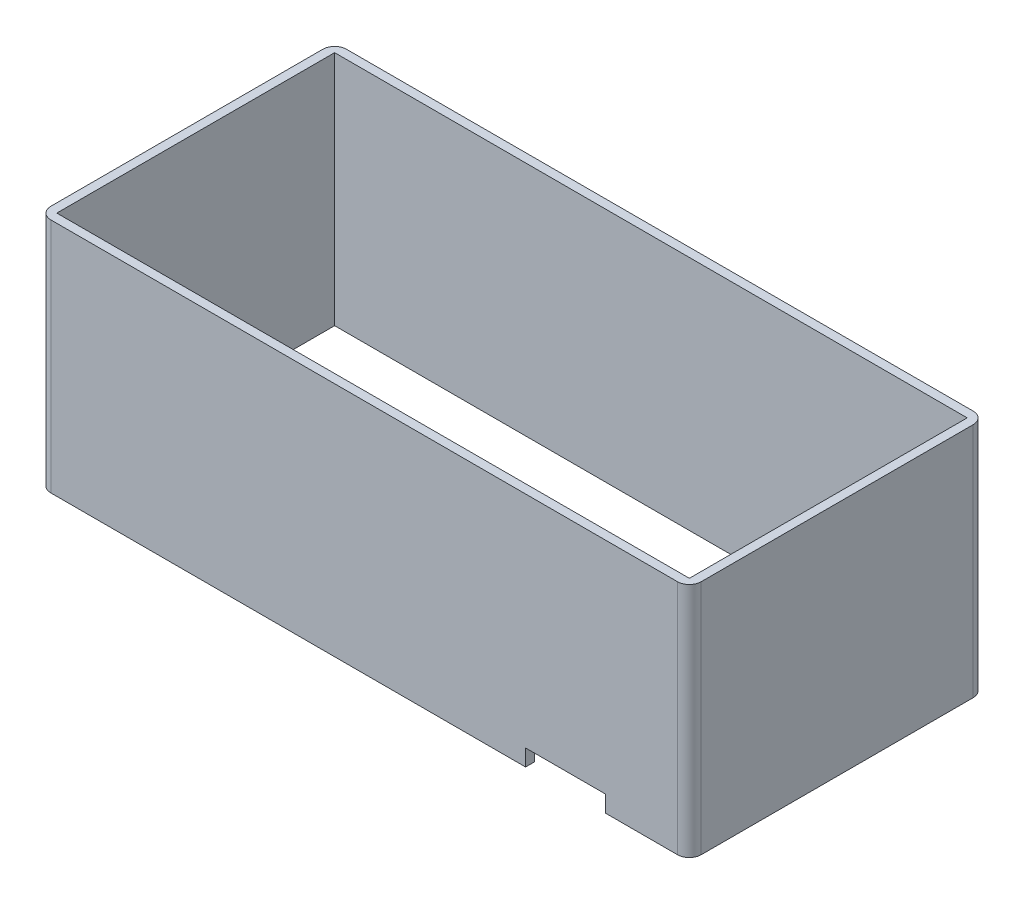
ISO-10303-21;
HEADER;
FILE_DESCRIPTION(('STEP AP214'),'2;1');
FILE_NAME('part.step','',(''),(''),'','','');
FILE_SCHEMA(('AUTOMOTIVE_DESIGN { 1 0 10303 214 1 1 1 1 }'));
ENDSEC;
DATA;
#1=APPLICATION_CONTEXT('core data for automotive mechanical design processes');
#2=APPLICATION_PROTOCOL_DEFINITION('international standard','automotive_design',2000,#1);
#3=PRODUCT_CONTEXT('',#1,'mechanical');
#4=PRODUCT('Part','Part','',(#3));
#5=PRODUCT_RELATED_PRODUCT_CATEGORY('part','',(#4));
#6=PRODUCT_DEFINITION_FORMATION('','',#4);
#7=PRODUCT_DEFINITION_CONTEXT('part definition',#1,'design');
#8=PRODUCT_DEFINITION('design','',#6,#7);
#9=PRODUCT_DEFINITION_SHAPE('','',#8);
#10=(LENGTH_UNIT() NAMED_UNIT(*) SI_UNIT(.MILLI.,.METRE.));
#11=(NAMED_UNIT(*) PLANE_ANGLE_UNIT() SI_UNIT($,.RADIAN.));
#12=(NAMED_UNIT(*) SI_UNIT($,.STERADIAN.) SOLID_ANGLE_UNIT());
#13=UNCERTAINTY_MEASURE_WITH_UNIT(LENGTH_MEASURE(1.E-05),#10,'distance_accuracy_value','');
#14=(GEOMETRIC_REPRESENTATION_CONTEXT(3) GLOBAL_UNCERTAINTY_ASSIGNED_CONTEXT((#13)) GLOBAL_UNIT_ASSIGNED_CONTEXT((#10,
#11,#12)) REPRESENTATION_CONTEXT('',''));
#15=CARTESIAN_POINT('',(0.,0.,0.));
#16=DIRECTION('',(0.,0.,1.));
#17=DIRECTION('',(1.,0.,0.));
#18=AXIS2_PLACEMENT_3D('',#15,#16,#17);
#19=CARTESIAN_POINT('',(0.,45.,0.));
#20=DIRECTION('',(0.,1.,0.));
#21=DIRECTION('',(0.,0.,1.));
#22=AXIS2_PLACEMENT_3D('',#19,#20,#21);
#23=PLANE('',#22);
#24=DIRECTION('',(1.,0.,0.));
#25=VECTOR('',#24,1.);
#26=CARTESIAN_POINT('',(-40.9090909090909,45.,30.8863636363636));
#27=LINE('',#26,#25);
#28=CARTESIAN_POINT('',(-38.9090909090909,45.,30.8863636363636));
#29=VERTEX_POINT('',#28);
#30=CARTESIAN_POINT('',(67.0909090909091,45.,30.8863636363636));
#31=VERTEX_POINT('',#30);
#32=EDGE_CURVE('E200',#29,#31,#27,.T.);
#33=ORIENTED_EDGE('',*,*,#32,.T.);
#34=CARTESIAN_POINT('',(67.0909090909091,45.,28.8863636363636));
#35=DIRECTION('',(0.,1.,0.));
#36=DIRECTION('',(0.,0.,1.));
#37=AXIS2_PLACEMENT_3D('',#34,#35,#36);
#38=CIRCLE('',#37,2.);
#39=CARTESIAN_POINT('',(69.0909090909091,45.,28.8863636363636));
#40=VERTEX_POINT('',#39);
#41=EDGE_CURVE('E261',#31,#40,#38,.T.);
#42=ORIENTED_EDGE('',*,*,#41,.T.);
#43=DIRECTION('',(0.,0.,-1.));
#44=VECTOR('',#43,1.);
#45=CARTESIAN_POINT('',(69.0909090909091,45.,-19.1136363636364));
#46=LINE('',#45,#44);
#47=CARTESIAN_POINT('',(69.0909090909091,45.,-17.1136363636364));
#48=VERTEX_POINT('',#47);
#49=EDGE_CURVE('E208',#40,#48,#46,.T.);
#50=ORIENTED_EDGE('',*,*,#49,.T.);
#51=CARTESIAN_POINT('',(67.0909090909091,45.,-17.1136363636364));
#52=DIRECTION('',(0.,1.,0.));
#53=DIRECTION('',(0.,0.,1.));
#54=AXIS2_PLACEMENT_3D('',#51,#52,#53);
#55=CIRCLE('',#54,2.);
#56=CARTESIAN_POINT('',(67.0909090909091,45.,-19.1136363636364));
#57=VERTEX_POINT('',#56);
#58=EDGE_CURVE('E259',#48,#57,#55,.T.);
#59=ORIENTED_EDGE('',*,*,#58,.T.);
#60=DIRECTION('',(-1.,0.,0.));
#61=VECTOR('',#60,1.);
#62=CARTESIAN_POINT('',(-40.9090909090909,45.,-19.1136363636364));
#63=LINE('',#62,#61);
#64=CARTESIAN_POINT('',(-38.9090909090909,45.,-19.1136363636364));
#65=VERTEX_POINT('',#64);
#66=EDGE_CURVE('E209',#57,#65,#63,.T.);
#67=ORIENTED_EDGE('',*,*,#66,.T.);
#68=CARTESIAN_POINT('',(-38.9090909090909,45.,-17.1136363636364));
#69=DIRECTION('',(0.,1.,0.));
#70=DIRECTION('',(0.,0.,1.));
#71=AXIS2_PLACEMENT_3D('',#68,#69,#70);
#72=CIRCLE('',#71,2.);
#73=CARTESIAN_POINT('',(-40.9090909090909,45.,-17.1136363636364));
#74=VERTEX_POINT('',#73);
#75=EDGE_CURVE('E257',#65,#74,#72,.T.);
#76=ORIENTED_EDGE('',*,*,#75,.T.);
#77=DIRECTION('',(0.,0.,1.));
#78=VECTOR('',#77,1.);
#79=CARTESIAN_POINT('',(-40.9090909090909,45.,-19.1136363636364));
#80=LINE('',#79,#78);
#81=CARTESIAN_POINT('',(-40.9090909090909,45.,28.8863636363636));
#82=VERTEX_POINT('',#81);
#83=EDGE_CURVE('E199',#74,#82,#80,.T.);
#84=ORIENTED_EDGE('',*,*,#83,.T.);
#85=CARTESIAN_POINT('',(-38.9090909090909,45.,28.8863636363636));
#86=DIRECTION('',(0.,1.,0.));
#87=DIRECTION('',(0.,0.,1.));
#88=AXIS2_PLACEMENT_3D('',#85,#86,#87);
#89=CIRCLE('',#88,2.);
#90=EDGE_CURVE('E255',#82,#29,#89,.T.);
#91=ORIENTED_EDGE('',*,*,#90,.T.);
#92=EDGE_LOOP('',(#33,#42,#50,#59,#67,#76,#84,#91));
#93=FACE_BOUND('',#92,.T.);
#94=DIRECTION('',(0.,0.,1.));
#95=VECTOR('',#94,1.);
#96=CARTESIAN_POINT('',(-39.4090909090909,45.,-19.1136363636364));
#97=LINE('',#96,#95);
#98=CARTESIAN_POINT('',(-39.4090909090909,45.,-17.6136363636364));
#99=VERTEX_POINT('',#98);
#100=CARTESIAN_POINT('',(-39.4090909090909,45.,29.3863636363636));
#101=VERTEX_POINT('',#100);
#102=EDGE_CURVE('E195',#99,#101,#97,.T.);
#103=ORIENTED_EDGE('',*,*,#102,.F.);
#104=DIRECTION('',(-1.,0.,0.));
#105=VECTOR('',#104,1.);
#106=CARTESIAN_POINT('',(-40.9090909090909,45.,-17.6136363636364));
#107=LINE('',#106,#105);
#108=CARTESIAN_POINT('',(67.5909090909091,45.,-17.6136363636364));
#109=VERTEX_POINT('',#108);
#110=EDGE_CURVE('E184',#109,#99,#107,.T.);
#111=ORIENTED_EDGE('',*,*,#110,.F.);
#112=DIRECTION('',(0.,0.,-1.));
#113=VECTOR('',#112,1.);
#114=CARTESIAN_POINT('',(67.5909090909091,45.,-19.1136363636364));
#115=LINE('',#114,#113);
#116=CARTESIAN_POINT('',(67.5909090909091,45.,29.3863636363636));
#117=VERTEX_POINT('',#116);
#118=EDGE_CURVE('E187',#117,#109,#115,.T.);
#119=ORIENTED_EDGE('',*,*,#118,.F.);
#120=DIRECTION('',(1.,0.,0.));
#121=VECTOR('',#120,1.);
#122=CARTESIAN_POINT('',(-40.9090909090909,45.,29.3863636363636));
#123=LINE('',#122,#121);
#124=EDGE_CURVE('E194',#101,#117,#123,.T.);
#125=ORIENTED_EDGE('',*,*,#124,.F.);
#126=EDGE_LOOP('',(#103,#111,#119,#125));
#127=FACE_BOUND('',#126,.T.);
#128=ADVANCED_FACE('F33',(#93,#127),#23,.T.);
#129=CARTESIAN_POINT('',(0.,4.99999999999999,0.));
#130=DIRECTION('',(0.,-1.,0.));
#131=DIRECTION('',(1.,0.,0.));
#132=AXIS2_PLACEMENT_3D('',#129,#130,#131);
#133=PLANE('',#132);
#134=DIRECTION('',(0.,0.,-1.));
#135=VECTOR('',#134,1.);
#136=CARTESIAN_POINT('',(41.3909090909091,4.99999999999999,30.8863636363636));
#137=LINE('',#136,#135);
#138=CARTESIAN_POINT('',(41.3909090909091,4.99999999999999,30.8863636363636));
#139=VERTEX_POINT('',#138);
#140=CARTESIAN_POINT('',(41.3909090909091,4.99999999999999,29.3863636363636));
#141=VERTEX_POINT('',#140);
#142=EDGE_CURVE('E152',#139,#141,#137,.T.);
#143=ORIENTED_EDGE('',*,*,#142,.F.);
#144=DIRECTION('',(-1.,0.,0.));
#145=VECTOR('',#144,1.);
#146=CARTESIAN_POINT('',(-40.9090909090909,4.99999999999998,30.8863636363636));
#147=LINE('',#146,#145);
#148=CARTESIAN_POINT('',(-38.9090909090909,4.99999999999998,30.8863636363636));
#149=VERTEX_POINT('',#148);
#150=EDGE_CURVE('E204',#139,#149,#147,.T.);
#151=ORIENTED_EDGE('',*,*,#150,.T.);
#152=CARTESIAN_POINT('',(-38.9090909090909,4.99999999999998,28.8863636363636));
#153=DIRECTION('',(0.,-1.,0.));
#154=DIRECTION('',(1.,0.,0.));
#155=AXIS2_PLACEMENT_3D('',#152,#153,#154);
#156=CIRCLE('',#155,2.);
#157=CARTESIAN_POINT('',(-40.9090909090909,4.99999999999998,28.8863636363636));
#158=VERTEX_POINT('',#157);
#159=EDGE_CURVE('E242',#149,#158,#156,.T.);
#160=ORIENTED_EDGE('',*,*,#159,.T.);
#161=DIRECTION('',(0.,0.,-1.));
#162=VECTOR('',#161,1.);
#163=CARTESIAN_POINT('',(-40.9090909090909,4.99999999999998,-19.1136363636364));
#164=LINE('',#163,#162);
#165=CARTESIAN_POINT('',(-40.9090909090909,4.99999999999998,-17.1136363636364));
#166=VERTEX_POINT('',#165);
#167=EDGE_CURVE('E196',#158,#166,#164,.T.);
#168=ORIENTED_EDGE('',*,*,#167,.T.);
#169=CARTESIAN_POINT('',(-38.9090909090909,4.99999999999998,-17.1136363636364));
#170=DIRECTION('',(0.,-1.,0.));
#171=DIRECTION('',(1.,0.,0.));
#172=AXIS2_PLACEMENT_3D('',#169,#170,#171);
#173=CIRCLE('',#172,2.);
#174=CARTESIAN_POINT('',(-38.9090909090909,4.99999999999998,-19.1136363636364));
#175=VERTEX_POINT('',#174);
#176=EDGE_CURVE('E244',#166,#175,#173,.T.);
#177=ORIENTED_EDGE('',*,*,#176,.T.);
#178=DIRECTION('',(1.,0.,0.));
#179=VECTOR('',#178,1.);
#180=CARTESIAN_POINT('',(-40.9090909090909,4.99999999999998,-19.1136363636364));
#181=LINE('',#180,#179);
#182=CARTESIAN_POINT('',(67.0909090909091,5.,-19.1136363636364));
#183=VERTEX_POINT('',#182);
#184=EDGE_CURVE('E176',#175,#183,#181,.T.);
#185=ORIENTED_EDGE('',*,*,#184,.T.);
#186=CARTESIAN_POINT('',(67.0909090909091,5.,-17.1136363636364));
#187=DIRECTION('',(0.,-1.,0.));
#188=DIRECTION('',(1.,0.,0.));
#189=AXIS2_PLACEMENT_3D('',#186,#187,#188);
#190=CIRCLE('',#189,2.);
#191=CARTESIAN_POINT('',(69.0909090909091,5.,-17.1136363636364));
#192=VERTEX_POINT('',#191);
#193=EDGE_CURVE('E246',#183,#192,#190,.T.);
#194=ORIENTED_EDGE('',*,*,#193,.T.);
#195=DIRECTION('',(0.,0.,1.));
#196=VECTOR('',#195,1.);
#197=CARTESIAN_POINT('',(69.0909090909091,5.,-19.1136363636364));
#198=LINE('',#197,#196);
#199=CARTESIAN_POINT('',(69.0909090909091,5.,28.8863636363636));
#200=VERTEX_POINT('',#199);
#201=EDGE_CURVE('E205',#192,#200,#198,.T.);
#202=ORIENTED_EDGE('',*,*,#201,.T.);
#203=CARTESIAN_POINT('',(67.0909090909091,5.,28.8863636363636));
#204=DIRECTION('',(0.,-1.,0.));
#205=DIRECTION('',(1.,0.,0.));
#206=AXIS2_PLACEMENT_3D('',#203,#204,#205);
#207=CIRCLE('',#206,2.);
#208=CARTESIAN_POINT('',(67.0909090909091,5.,30.8863636363636));
#209=VERTEX_POINT('',#208);
#210=EDGE_CURVE('E248',#200,#209,#207,.T.);
#211=ORIENTED_EDGE('',*,*,#210,.T.);
#212=CARTESIAN_POINT('',(54.8909090909091,5.,30.8863636363636));
#213=VERTEX_POINT('',#212);
#214=EDGE_CURVE('E201',#209,#213,#147,.T.);
#215=ORIENTED_EDGE('',*,*,#214,.T.);
#216=DIRECTION('',(0.,0.,1.));
#217=VECTOR('',#216,1.);
#218=CARTESIAN_POINT('',(54.8909090909091,5.,30.8863636363636));
#219=LINE('',#218,#217);
#220=CARTESIAN_POINT('',(54.8909090909091,5.,29.3863636363636));
#221=VERTEX_POINT('',#220);
#222=EDGE_CURVE('E164',#221,#213,#219,.T.);
#223=ORIENTED_EDGE('',*,*,#222,.F.);
#224=DIRECTION('',(-1.,0.,0.));
#225=VECTOR('',#224,1.);
#226=CARTESIAN_POINT('',(-40.9090909090909,4.99999999999998,29.3863636363636));
#227=LINE('',#226,#225);
#228=CARTESIAN_POINT('',(67.5909090909091,5.,29.3863636363636));
#229=VERTEX_POINT('',#228);
#230=EDGE_CURVE('E188',#229,#221,#227,.T.);
#231=ORIENTED_EDGE('',*,*,#230,.F.);
#232=DIRECTION('',(0.,0.,1.));
#233=VECTOR('',#232,1.);
#234=CARTESIAN_POINT('',(67.5909090909091,5.,-19.1136363636364));
#235=LINE('',#234,#233);
#236=CARTESIAN_POINT('',(67.5909090909091,4.99999999999999,-17.6136363636364));
#237=VERTEX_POINT('',#236);
#238=EDGE_CURVE('E185',#237,#229,#235,.T.);
#239=ORIENTED_EDGE('',*,*,#238,.F.);
#240=DIRECTION('',(1.,0.,0.));
#241=VECTOR('',#240,1.);
#242=CARTESIAN_POINT('',(-40.9090909090909,4.99999999999998,-17.6136363636364));
#243=LINE('',#242,#241);
#244=CARTESIAN_POINT('',(-39.4090909090909,4.99999999999999,-17.6136363636364));
#245=VERTEX_POINT('',#244);
#246=EDGE_CURVE('E181',#245,#237,#243,.T.);
#247=ORIENTED_EDGE('',*,*,#246,.F.);
#248=DIRECTION('',(0.,0.,-1.));
#249=VECTOR('',#248,1.);
#250=CARTESIAN_POINT('',(-39.4090909090909,4.99999999999998,-19.1136363636364));
#251=LINE('',#250,#249);
#252=CARTESIAN_POINT('',(-39.4090909090909,4.99999999999999,29.3863636363636));
#253=VERTEX_POINT('',#252);
#254=EDGE_CURVE('E191',#253,#245,#251,.T.);
#255=ORIENTED_EDGE('',*,*,#254,.F.);
#256=EDGE_CURVE('E190',#141,#253,#227,.T.);
#257=ORIENTED_EDGE('',*,*,#256,.F.);
#258=EDGE_LOOP('',(#143,#151,#160,#168,#177,#185,#194,#202,#211,#215,#223,#231,#239,#247,#255,#257));
#259=FACE_BOUND('',#258,.T.);
#260=ADVANCED_FACE('F276',(#259),#133,.T.);
#261=CARTESIAN_POINT('',(-40.9090909090909,48.,29.3863636363636));
#262=DIRECTION('',(0.,0.,-1.));
#263=DIRECTION('',(-1.,0.,0.));
#264=AXIS2_PLACEMENT_3D('',#261,#262,#263);
#265=PLANE('',#264);
#266=DIRECTION('',(0.,-1.,0.));
#267=VECTOR('',#266,1.);
#268=CARTESIAN_POINT('',(41.3909090909091,7.79999999999999,29.3863636363636));
#269=LINE('',#268,#267);
#270=CARTESIAN_POINT('',(41.3909090909091,7.79999999999999,29.3863636363636));
#271=VERTEX_POINT('',#270);
#272=EDGE_CURVE('E147',#271,#141,#269,.T.);
#273=ORIENTED_EDGE('',*,*,#272,.T.);
#274=ORIENTED_EDGE('',*,*,#256,.T.);
#275=DIRECTION('',(0.,-1.,0.));
#276=VECTOR('',#275,1.);
#277=CARTESIAN_POINT('',(-39.4090909090909,48.,29.3863636363636));
#278=LINE('',#277,#276);
#279=EDGE_CURVE('E183',#101,#253,#278,.T.);
#280=ORIENTED_EDGE('',*,*,#279,.F.);
#281=ORIENTED_EDGE('',*,*,#124,.T.);
#282=DIRECTION('',(0.,-1.,0.));
#283=VECTOR('',#282,1.);
#284=CARTESIAN_POINT('',(67.5909090909091,48.,29.3863636363636));
#285=LINE('',#284,#283);
#286=EDGE_CURVE('E219',#117,#229,#285,.T.);
#287=ORIENTED_EDGE('',*,*,#286,.T.);
#288=ORIENTED_EDGE('',*,*,#230,.T.);
#289=DIRECTION('',(0.,-1.,0.));
#290=VECTOR('',#289,1.);
#291=CARTESIAN_POINT('',(54.8909090909091,7.8,29.3863636363636));
#292=LINE('',#291,#290);
#293=CARTESIAN_POINT('',(54.8909090909091,7.8,29.3863636363636));
#294=VERTEX_POINT('',#293);
#295=EDGE_CURVE('E156',#294,#221,#292,.T.);
#296=ORIENTED_EDGE('',*,*,#295,.F.);
#297=DIRECTION('',(1.,0.,0.));
#298=VECTOR('',#297,1.);
#299=CARTESIAN_POINT('',(41.3909090909091,7.79999999999999,29.3863636363636));
#300=LINE('',#299,#298);
#301=EDGE_CURVE('E160',#271,#294,#300,.T.);
#302=ORIENTED_EDGE('',*,*,#301,.F.);
#303=EDGE_LOOP('',(#273,#274,#280,#281,#287,#288,#296,#302));
#304=FACE_BOUND('',#303,.T.);
#305=ADVANCED_FACE('F166',(#304),#265,.T.);
#306=CARTESIAN_POINT('',(-39.4090909090909,48.,-19.1136363636364));
#307=DIRECTION('',(1.,0.,0.));
#308=DIRECTION('',(0.,0.,-1.));
#309=AXIS2_PLACEMENT_3D('',#306,#307,#308);
#310=PLANE('',#309);
#311=DIRECTION('',(0.,-1.,0.));
#312=VECTOR('',#311,1.);
#313=CARTESIAN_POINT('',(-39.4090909090909,48.,-17.6136363636364));
#314=LINE('',#313,#312);
#315=EDGE_CURVE('E212',#99,#245,#314,.T.);
#316=ORIENTED_EDGE('',*,*,#315,.F.);
#317=ORIENTED_EDGE('',*,*,#102,.T.);
#318=ORIENTED_EDGE('',*,*,#279,.T.);
#319=ORIENTED_EDGE('',*,*,#254,.T.);
#320=EDGE_LOOP('',(#316,#317,#318,#319));
#321=FACE_BOUND('',#320,.T.);
#322=ADVANCED_FACE('F317',(#321),#310,.T.);
#323=CARTESIAN_POINT('',(67.5909090909091,48.,-19.1136363636364));
#324=DIRECTION('',(-1.,0.,0.));
#325=DIRECTION('',(0.,0.,1.));
#326=AXIS2_PLACEMENT_3D('',#323,#324,#325);
#327=PLANE('',#326);
#328=ORIENTED_EDGE('',*,*,#286,.F.);
#329=ORIENTED_EDGE('',*,*,#118,.T.);
#330=DIRECTION('',(0.,-1.,0.));
#331=VECTOR('',#330,1.);
#332=CARTESIAN_POINT('',(67.5909090909091,48.,-17.6136363636364));
#333=LINE('',#332,#331);
#334=EDGE_CURVE('E216',#109,#237,#333,.T.);
#335=ORIENTED_EDGE('',*,*,#334,.T.);
#336=ORIENTED_EDGE('',*,*,#238,.T.);
#337=EDGE_LOOP('',(#328,#329,#335,#336));
#338=FACE_BOUND('',#337,.T.);
#339=ADVANCED_FACE('F311',(#338),#327,.T.);
#340=CARTESIAN_POINT('',(-40.9090909090909,48.,-17.6136363636364));
#341=DIRECTION('',(0.,0.,1.));
#342=DIRECTION('',(1.,0.,0.));
#343=AXIS2_PLACEMENT_3D('',#340,#341,#342);
#344=PLANE('',#343);
#345=ORIENTED_EDGE('',*,*,#334,.F.);
#346=ORIENTED_EDGE('',*,*,#110,.T.);
#347=ORIENTED_EDGE('',*,*,#315,.T.);
#348=ORIENTED_EDGE('',*,*,#246,.T.);
#349=EDGE_LOOP('',(#345,#346,#347,#348));
#350=FACE_BOUND('',#349,.T.);
#351=ADVANCED_FACE('F318',(#350),#344,.T.);
#352=CARTESIAN_POINT('',(-40.9090909090909,50.,30.8863636363636));
#353=DIRECTION('',(0.,0.,-1.));
#354=DIRECTION('',(-1.,0.,0.));
#355=AXIS2_PLACEMENT_3D('',#352,#353,#354);
#356=PLANE('',#355);
#357=ORIENTED_EDGE('',*,*,#150,.F.);
#358=DIRECTION('',(0.,-1.,0.));
#359=VECTOR('',#358,1.);
#360=CARTESIAN_POINT('',(41.3909090909091,7.79999999999999,30.8863636363636));
#361=LINE('',#360,#359);
#362=CARTESIAN_POINT('',(41.3909090909091,7.79999999999999,30.8863636363636));
#363=VERTEX_POINT('',#362);
#364=EDGE_CURVE('E174',#363,#139,#361,.T.);
#365=ORIENTED_EDGE('',*,*,#364,.F.);
#366=DIRECTION('',(-1.,0.,0.));
#367=VECTOR('',#366,1.);
#368=CARTESIAN_POINT('',(41.3909090909091,7.79999999999999,30.8863636363636));
#369=LINE('',#368,#367);
#370=CARTESIAN_POINT('',(54.8909090909091,7.79999999999999,30.8863636363636));
#371=VERTEX_POINT('',#370);
#372=EDGE_CURVE('E157',#371,#363,#369,.T.);
#373=ORIENTED_EDGE('',*,*,#372,.F.);
#374=DIRECTION('',(0.,-1.,0.));
#375=VECTOR('',#374,1.);
#376=CARTESIAN_POINT('',(54.8909090909091,7.8,30.8863636363636));
#377=LINE('',#376,#375);
#378=EDGE_CURVE('E177',#371,#213,#377,.T.);
#379=ORIENTED_EDGE('',*,*,#378,.T.);
#380=ORIENTED_EDGE('',*,*,#214,.F.);
#381=DIRECTION('',(0.,-1.,0.));
#382=VECTOR('',#381,1.);
#383=CARTESIAN_POINT('',(67.0909090909091,50.,30.8863636363636));
#384=LINE('',#383,#382);
#385=EDGE_CURVE('E253',#209,#31,#384,.F.);
#386=ORIENTED_EDGE('',*,*,#385,.T.);
#387=ORIENTED_EDGE('',*,*,#32,.F.);
#388=DIRECTION('',(0.,-1.,0.));
#389=VECTOR('',#388,1.);
#390=CARTESIAN_POINT('',(-38.9090909090909,50.,30.8863636363636));
#391=LINE('',#390,#389);
#392=EDGE_CURVE('E250',#29,#149,#391,.T.);
#393=ORIENTED_EDGE('',*,*,#392,.T.);
#394=EDGE_LOOP('',(#357,#365,#373,#379,#380,#386,#387,#393));
#395=FACE_BOUND('',#394,.T.);
#396=ADVANCED_FACE('F292',(#395),#356,.F.);
#397=CARTESIAN_POINT('',(-40.9090909090909,50.,-19.1136363636364));
#398=DIRECTION('',(1.,0.,0.));
#399=DIRECTION('',(0.,0.,-1.));
#400=AXIS2_PLACEMENT_3D('',#397,#398,#399);
#401=PLANE('',#400);
#402=ORIENTED_EDGE('',*,*,#83,.F.);
#403=DIRECTION('',(0.,-1.,0.));
#404=VECTOR('',#403,1.);
#405=CARTESIAN_POINT('',(-40.9090909090909,50.,-17.1136363636364));
#406=LINE('',#405,#404);
#407=EDGE_CURVE('E11',#74,#166,#406,.T.);
#408=ORIENTED_EDGE('',*,*,#407,.T.);
#409=ORIENTED_EDGE('',*,*,#167,.F.);
#410=DIRECTION('',(0.,-1.,0.));
#411=VECTOR('',#410,1.);
#412=CARTESIAN_POINT('',(-40.9090909090909,50.,28.8863636363636));
#413=LINE('',#412,#411);
#414=EDGE_CURVE('E41',#158,#82,#413,.F.);
#415=ORIENTED_EDGE('',*,*,#414,.T.);
#416=EDGE_LOOP('',(#402,#408,#409,#415));
#417=FACE_BOUND('',#416,.T.);
#418=ADVANCED_FACE('F282',(#417),#401,.F.);
#419=CARTESIAN_POINT('',(69.0909090909091,50.,-19.1136363636364));
#420=DIRECTION('',(-1.,0.,0.));
#421=DIRECTION('',(0.,0.,1.));
#422=AXIS2_PLACEMENT_3D('',#419,#420,#421);
#423=PLANE('',#422);
#424=ORIENTED_EDGE('',*,*,#49,.F.);
#425=DIRECTION('',(0.,-1.,0.));
#426=VECTOR('',#425,1.);
#427=CARTESIAN_POINT('',(69.0909090909091,50.,28.8863636363636));
#428=LINE('',#427,#426);
#429=EDGE_CURVE('E239',#40,#200,#428,.T.);
#430=ORIENTED_EDGE('',*,*,#429,.T.);
#431=ORIENTED_EDGE('',*,*,#201,.F.);
#432=DIRECTION('',(0.,-1.,0.));
#433=VECTOR('',#432,1.);
#434=CARTESIAN_POINT('',(69.0909090909091,50.,-17.1136363636364));
#435=LINE('',#434,#433);
#436=EDGE_CURVE('E215',#192,#48,#435,.F.);
#437=ORIENTED_EDGE('',*,*,#436,.T.);
#438=EDGE_LOOP('',(#424,#430,#431,#437));
#439=FACE_BOUND('',#438,.T.);
#440=ADVANCED_FACE('F301',(#439),#423,.F.);
#441=CARTESIAN_POINT('',(-40.9090909090909,50.,-19.1136363636364));
#442=DIRECTION('',(0.,0.,1.));
#443=DIRECTION('',(1.,0.,0.));
#444=AXIS2_PLACEMENT_3D('',#441,#442,#443);
#445=PLANE('',#444);
#446=ORIENTED_EDGE('',*,*,#66,.F.);
#447=DIRECTION('',(0.,-1.,0.));
#448=VECTOR('',#447,1.);
#449=CARTESIAN_POINT('',(67.0909090909091,50.,-19.1136363636364));
#450=LINE('',#449,#448);
#451=EDGE_CURVE('E265',#57,#183,#450,.T.);
#452=ORIENTED_EDGE('',*,*,#451,.T.);
#453=ORIENTED_EDGE('',*,*,#184,.F.);
#454=DIRECTION('',(0.,-1.,0.));
#455=VECTOR('',#454,1.);
#456=CARTESIAN_POINT('',(-38.9090909090909,50.,-19.1136363636364));
#457=LINE('',#456,#455);
#458=EDGE_CURVE('E263',#175,#65,#457,.F.);
#459=ORIENTED_EDGE('',*,*,#458,.T.);
#460=EDGE_LOOP('',(#446,#452,#453,#459));
#461=FACE_BOUND('',#460,.T.);
#462=ADVANCED_FACE('F271',(#461),#445,.F.);
#463=CARTESIAN_POINT('',(67.0909090909091,50.,28.8863636363636));
#464=DIRECTION('',(0.,-1.,0.));
#465=DIRECTION('',(0.,0.,-1.));
#466=AXIS2_PLACEMENT_3D('',#463,#464,#465);
#467=CYLINDRICAL_SURFACE('',#466,2.);
#468=ORIENTED_EDGE('',*,*,#41,.F.);
#469=ORIENTED_EDGE('',*,*,#385,.F.);
#470=ORIENTED_EDGE('',*,*,#210,.F.);
#471=ORIENTED_EDGE('',*,*,#429,.F.);
#472=EDGE_LOOP('',(#468,#469,#470,#471));
#473=FACE_BOUND('',#472,.T.);
#474=ADVANCED_FACE('F299',(#473),#467,.T.);
#475=CARTESIAN_POINT('',(67.0909090909091,50.,-17.1136363636364));
#476=DIRECTION('',(0.,-1.,0.));
#477=DIRECTION('',(0.,0.,-1.));
#478=AXIS2_PLACEMENT_3D('',#475,#476,#477);
#479=CYLINDRICAL_SURFACE('',#478,2.);
#480=ORIENTED_EDGE('',*,*,#58,.F.);
#481=ORIENTED_EDGE('',*,*,#436,.F.);
#482=ORIENTED_EDGE('',*,*,#193,.F.);
#483=ORIENTED_EDGE('',*,*,#451,.F.);
#484=EDGE_LOOP('',(#480,#481,#482,#483));
#485=FACE_BOUND('',#484,.T.);
#486=ADVANCED_FACE('F348',(#485),#479,.T.);
#487=CARTESIAN_POINT('',(-38.9090909090909,50.,-17.1136363636364));
#488=DIRECTION('',(0.,-1.,0.));
#489=DIRECTION('',(0.,0.,-1.));
#490=AXIS2_PLACEMENT_3D('',#487,#488,#489);
#491=CYLINDRICAL_SURFACE('',#490,2.);
#492=ORIENTED_EDGE('',*,*,#75,.F.);
#493=ORIENTED_EDGE('',*,*,#458,.F.);
#494=ORIENTED_EDGE('',*,*,#176,.F.);
#495=ORIENTED_EDGE('',*,*,#407,.F.);
#496=EDGE_LOOP('',(#492,#493,#494,#495));
#497=FACE_BOUND('',#496,.T.);
#498=ADVANCED_FACE('F281',(#497),#491,.T.);
#499=CARTESIAN_POINT('',(-38.9090909090909,50.,28.8863636363636));
#500=DIRECTION('',(0.,-1.,0.));
#501=DIRECTION('',(0.,0.,-1.));
#502=AXIS2_PLACEMENT_3D('',#499,#500,#501);
#503=CYLINDRICAL_SURFACE('',#502,2.);
#504=ORIENTED_EDGE('',*,*,#90,.F.);
#505=ORIENTED_EDGE('',*,*,#414,.F.);
#506=ORIENTED_EDGE('',*,*,#159,.F.);
#507=ORIENTED_EDGE('',*,*,#392,.F.);
#508=EDGE_LOOP('',(#504,#505,#506,#507));
#509=FACE_BOUND('',#508,.T.);
#510=ADVANCED_FACE('F35',(#509),#503,.T.);
#511=CARTESIAN_POINT('',(41.3909090909091,7.79999999999999,30.8863636363636));
#512=DIRECTION('',(-1.,0.,0.));
#513=DIRECTION('',(0.,-1.,0.));
#514=AXIS2_PLACEMENT_3D('',#511,#512,#513);
#515=PLANE('',#514);
#516=ORIENTED_EDGE('',*,*,#142,.T.);
#517=ORIENTED_EDGE('',*,*,#272,.F.);
#518=DIRECTION('',(0.,0.,-1.));
#519=VECTOR('',#518,1.);
#520=CARTESIAN_POINT('',(41.3909090909091,7.79999999999999,30.8863636363636));
#521=LINE('',#520,#519);
#522=EDGE_CURVE('E150',#363,#271,#521,.T.);
#523=ORIENTED_EDGE('',*,*,#522,.F.);
#524=ORIENTED_EDGE('',*,*,#364,.T.);
#525=EDGE_LOOP('',(#516,#517,#523,#524));
#526=FACE_BOUND('',#525,.T.);
#527=ADVANCED_FACE('F149',(#526),#515,.F.);
#528=CARTESIAN_POINT('',(54.8909090909091,7.8,30.8863636363636));
#529=DIRECTION('',(1.,0.,0.));
#530=DIRECTION('',(0.,1.,0.));
#531=AXIS2_PLACEMENT_3D('',#528,#529,#530);
#532=PLANE('',#531);
#533=ORIENTED_EDGE('',*,*,#222,.T.);
#534=ORIENTED_EDGE('',*,*,#378,.F.);
#535=DIRECTION('',(0.,0.,1.));
#536=VECTOR('',#535,1.);
#537=CARTESIAN_POINT('',(54.8909090909091,7.8,30.8863636363636));
#538=LINE('',#537,#536);
#539=EDGE_CURVE('E48',#294,#371,#538,.T.);
#540=ORIENTED_EDGE('',*,*,#539,.F.);
#541=ORIENTED_EDGE('',*,*,#295,.T.);
#542=EDGE_LOOP('',(#533,#534,#540,#541));
#543=FACE_BOUND('',#542,.T.);
#544=ADVANCED_FACE('F305',(#543),#532,.F.);
#545=CARTESIAN_POINT('',(0.,7.79999999999999,0.));
#546=DIRECTION('',(0.,-1.,0.));
#547=DIRECTION('',(1.,0.,0.));
#548=AXIS2_PLACEMENT_3D('',#545,#546,#547);
#549=PLANE('',#548);
#550=ORIENTED_EDGE('',*,*,#522,.T.);
#551=ORIENTED_EDGE('',*,*,#301,.T.);
#552=ORIENTED_EDGE('',*,*,#539,.T.);
#553=ORIENTED_EDGE('',*,*,#372,.T.);
#554=EDGE_LOOP('',(#550,#551,#552,#553));
#555=FACE_BOUND('',#554,.T.);
#556=ADVANCED_FACE('F159',(#555),#549,.T.);
#557=CLOSED_SHELL('',(#128,#260,#305,#322,#339,#351,#396,#418,#440,#462,#474,#486,#498,#510,
#527,#544,#556));
#558=MANIFOLD_SOLID_BREP('B2',#557);
#559=ADVANCED_BREP_SHAPE_REPRESENTATION('',(#18,#558),#14);
#560=SHAPE_DEFINITION_REPRESENTATION(#9,#559);
ENDSEC;
END-ISO-10303-21;
